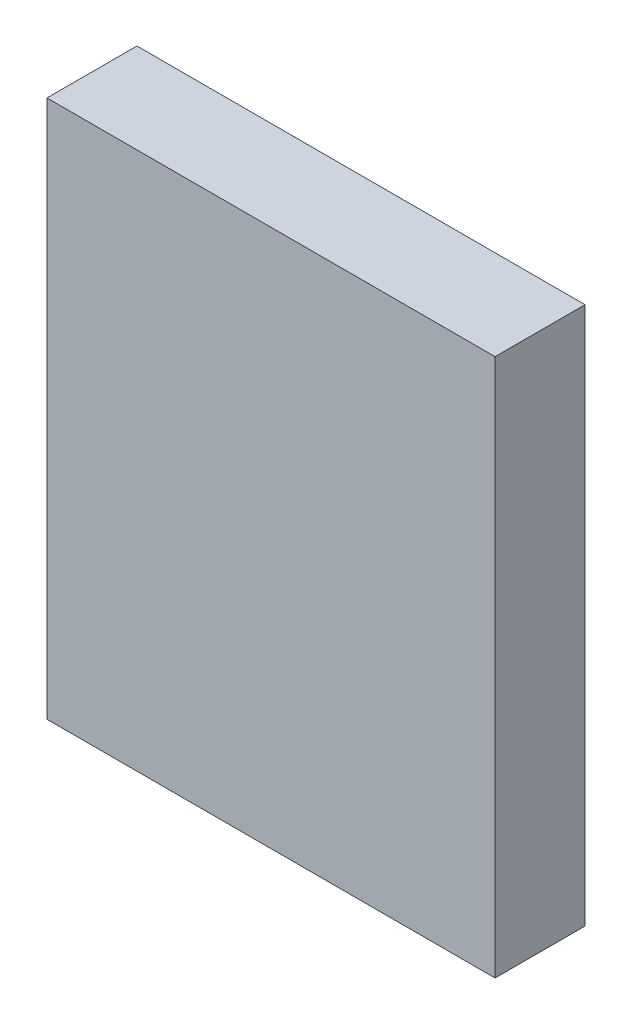
ISO-10303-21;
HEADER;
FILE_DESCRIPTION(('STEP AP214'),'2;1');
FILE_NAME('part.step','',(''),(''),'','','');
FILE_SCHEMA(('AUTOMOTIVE_DESIGN { 1 0 10303 214 1 1 1 1 }'));
ENDSEC;
DATA;
#1=APPLICATION_CONTEXT('core data for automotive mechanical design processes');
#2=APPLICATION_PROTOCOL_DEFINITION('international standard','automotive_design',2000,#1);
#3=PRODUCT_CONTEXT('',#1,'mechanical');
#4=PRODUCT('Part','Part','',(#3));
#5=PRODUCT_RELATED_PRODUCT_CATEGORY('part','',(#4));
#6=PRODUCT_DEFINITION_FORMATION('','',#4);
#7=PRODUCT_DEFINITION_CONTEXT('part definition',#1,'design');
#8=PRODUCT_DEFINITION('design','',#6,#7);
#9=PRODUCT_DEFINITION_SHAPE('','',#8);
#10=(LENGTH_UNIT() NAMED_UNIT(*) SI_UNIT(.MILLI.,.METRE.));
#11=(NAMED_UNIT(*) PLANE_ANGLE_UNIT() SI_UNIT($,.RADIAN.));
#12=(NAMED_UNIT(*) SI_UNIT($,.STERADIAN.) SOLID_ANGLE_UNIT());
#13=UNCERTAINTY_MEASURE_WITH_UNIT(LENGTH_MEASURE(1.E-05),#10,'distance_accuracy_value','');
#14=(GEOMETRIC_REPRESENTATION_CONTEXT(3) GLOBAL_UNCERTAINTY_ASSIGNED_CONTEXT((#13)) GLOBAL_UNIT_ASSIGNED_CONTEXT((#10,
#11,#12)) REPRESENTATION_CONTEXT('',''));
#15=CARTESIAN_POINT('',(0.,0.,0.));
#16=DIRECTION('',(0.,0.,1.));
#17=DIRECTION('',(1.,0.,0.));
#18=AXIS2_PLACEMENT_3D('',#15,#16,#17);
#19=CARTESIAN_POINT('',(0.373,0.698,0.));
#20=DIRECTION('',(0.,-1.,0.));
#21=DIRECTION('',(0.,0.,1.));
#22=AXIS2_PLACEMENT_3D('',#19,#20,#21);
#23=PLANE('',#22);
#24=DIRECTION('',(-1.,0.,0.));
#25=VECTOR('',#24,1.);
#26=CARTESIAN_POINT('',(0.627,0.698,0.));
#27=LINE('',#26,#25);
#28=CARTESIAN_POINT('',(0.627,0.698,0.));
#29=VERTEX_POINT('',#28);
#30=CARTESIAN_POINT('',(0.373,0.698,0.));
#31=VERTEX_POINT('',#30);
#32=EDGE_CURVE('E11',#29,#31,#27,.T.);
#33=ORIENTED_EDGE('',*,*,#32,.F.);
#34=DIRECTION('',(0.,0.,-1.));
#35=VECTOR('',#34,1.);
#36=CARTESIAN_POINT('',(0.627,0.698,0.051));
#37=LINE('',#36,#35);
#38=CARTESIAN_POINT('',(0.627,0.698,0.051));
#39=VERTEX_POINT('',#38);
#40=EDGE_CURVE('E24',#39,#29,#37,.T.);
#41=ORIENTED_EDGE('',*,*,#40,.F.);
#42=DIRECTION('',(1.,0.,0.));
#43=VECTOR('',#42,1.);
#44=CARTESIAN_POINT('',(0.373,0.698,0.051));
#45=LINE('',#44,#43);
#46=CARTESIAN_POINT('',(0.373,0.698,0.051));
#47=VERTEX_POINT('',#46);
#48=EDGE_CURVE('E88',#47,#39,#45,.T.);
#49=ORIENTED_EDGE('',*,*,#48,.F.);
#50=DIRECTION('',(0.,0.,1.));
#51=VECTOR('',#50,1.);
#52=CARTESIAN_POINT('',(0.373,0.698,0.));
#53=LINE('',#52,#51);
#54=EDGE_CURVE('E77',#31,#47,#53,.T.);
#55=ORIENTED_EDGE('',*,*,#54,.F.);
#56=EDGE_LOOP('',(#33,#41,#49,#55));
#57=FACE_BOUND('',#56,.T.);
#58=ADVANCED_FACE('F17',(#57),#23,.T.);
#59=CARTESIAN_POINT('',(0.627,0.698,0.));
#60=DIRECTION('',(1.,0.,0.));
#61=DIRECTION('',(0.,0.,1.));
#62=AXIS2_PLACEMENT_3D('',#59,#60,#61);
#63=PLANE('',#62);
#64=DIRECTION('',(0.,-1.,0.));
#65=VECTOR('',#64,1.);
#66=CARTESIAN_POINT('',(0.627,1.003,0.));
#67=LINE('',#66,#65);
#68=CARTESIAN_POINT('',(0.627,1.003,0.));
#69=VERTEX_POINT('',#68);
#70=EDGE_CURVE('E85',#69,#29,#67,.T.);
#71=ORIENTED_EDGE('',*,*,#70,.F.);
#72=DIRECTION('',(0.,0.,-1.));
#73=VECTOR('',#72,1.);
#74=CARTESIAN_POINT('',(0.627,1.003,0.051));
#75=LINE('',#74,#73);
#76=CARTESIAN_POINT('',(0.627,1.003,0.051));
#77=VERTEX_POINT('',#76);
#78=EDGE_CURVE('E83',#77,#69,#75,.T.);
#79=ORIENTED_EDGE('',*,*,#78,.F.);
#80=DIRECTION('',(0.,1.,0.));
#81=VECTOR('',#80,1.);
#82=CARTESIAN_POINT('',(0.627,0.698,0.051));
#83=LINE('',#82,#81);
#84=EDGE_CURVE('E72',#39,#77,#83,.T.);
#85=ORIENTED_EDGE('',*,*,#84,.F.);
#86=ORIENTED_EDGE('',*,*,#40,.T.);
#87=EDGE_LOOP('',(#71,#79,#85,#86));
#88=FACE_BOUND('',#87,.T.);
#89=ADVANCED_FACE('F90',(#88),#63,.T.);
#90=CARTESIAN_POINT('',(0.627,1.003,0.));
#91=DIRECTION('',(0.,1.,0.));
#92=DIRECTION('',(0.,0.,1.));
#93=AXIS2_PLACEMENT_3D('',#90,#91,#92);
#94=PLANE('',#93);
#95=DIRECTION('',(1.,0.,0.));
#96=VECTOR('',#95,1.);
#97=CARTESIAN_POINT('',(0.373,1.003,0.));
#98=LINE('',#97,#96);
#99=CARTESIAN_POINT('',(0.373,1.003,0.));
#100=VERTEX_POINT('',#99);
#101=EDGE_CURVE('E60',#100,#69,#98,.T.);
#102=ORIENTED_EDGE('',*,*,#101,.F.);
#103=DIRECTION('',(0.,0.,-1.));
#104=VECTOR('',#103,1.);
#105=CARTESIAN_POINT('',(0.373,1.003,0.051));
#106=LINE('',#105,#104);
#107=CARTESIAN_POINT('',(0.373,1.003,0.051));
#108=VERTEX_POINT('',#107);
#109=EDGE_CURVE('E54',#108,#100,#106,.T.);
#110=ORIENTED_EDGE('',*,*,#109,.F.);
#111=DIRECTION('',(-1.,0.,0.));
#112=VECTOR('',#111,1.);
#113=CARTESIAN_POINT('',(0.627,1.003,0.051));
#114=LINE('',#113,#112);
#115=EDGE_CURVE('E58',#77,#108,#114,.T.);
#116=ORIENTED_EDGE('',*,*,#115,.F.);
#117=ORIENTED_EDGE('',*,*,#78,.T.);
#118=EDGE_LOOP('',(#102,#110,#116,#117));
#119=FACE_BOUND('',#118,.T.);
#120=ADVANCED_FACE('F56',(#119),#94,.T.);
#121=CARTESIAN_POINT('',(0.373,1.003,0.));
#122=DIRECTION('',(-1.,0.,0.));
#123=DIRECTION('',(0.,0.,1.));
#124=AXIS2_PLACEMENT_3D('',#121,#122,#123);
#125=PLANE('',#124);
#126=DIRECTION('',(0.,1.,0.));
#127=VECTOR('',#126,1.);
#128=CARTESIAN_POINT('',(0.373,0.698,0.));
#129=LINE('',#128,#127);
#130=EDGE_CURVE('E73',#31,#100,#129,.T.);
#131=ORIENTED_EDGE('',*,*,#130,.F.);
#132=ORIENTED_EDGE('',*,*,#54,.T.);
#133=DIRECTION('',(0.,-1.,0.));
#134=VECTOR('',#133,1.);
#135=CARTESIAN_POINT('',(0.373,1.003,0.051));
#136=LINE('',#135,#134);
#137=EDGE_CURVE('E70',#108,#47,#136,.T.);
#138=ORIENTED_EDGE('',*,*,#137,.F.);
#139=ORIENTED_EDGE('',*,*,#109,.T.);
#140=EDGE_LOOP('',(#131,#132,#138,#139));
#141=FACE_BOUND('',#140,.T.);
#142=ADVANCED_FACE('F76',(#141),#125,.T.);
#143=CARTESIAN_POINT('',(0.373,1.003,0.));
#144=DIRECTION('',(0.,0.,-1.));
#145=DIRECTION('',(0.,1.,0.));
#146=AXIS2_PLACEMENT_3D('',#143,#144,#145);
#147=PLANE('',#146);
#148=ORIENTED_EDGE('',*,*,#101,.T.);
#149=ORIENTED_EDGE('',*,*,#70,.T.);
#150=ORIENTED_EDGE('',*,*,#32,.T.);
#151=ORIENTED_EDGE('',*,*,#130,.T.);
#152=EDGE_LOOP('',(#148,#149,#150,#151));
#153=FACE_BOUND('',#152,.T.);
#154=ADVANCED_FACE('F91',(#153),#147,.T.);
#155=CARTESIAN_POINT('',(0.373,0.698,0.051));
#156=DIRECTION('',(0.,0.,1.));
#157=DIRECTION('',(0.,1.,0.));
#158=AXIS2_PLACEMENT_3D('',#155,#156,#157);
#159=PLANE('',#158);
#160=ORIENTED_EDGE('',*,*,#48,.T.);
#161=ORIENTED_EDGE('',*,*,#84,.T.);
#162=ORIENTED_EDGE('',*,*,#115,.T.);
#163=ORIENTED_EDGE('',*,*,#137,.T.);
#164=EDGE_LOOP('',(#160,#161,#162,#163));
#165=FACE_BOUND('',#164,.T.);
#166=ADVANCED_FACE('F69',(#165),#159,.T.);
#167=CLOSED_SHELL('',(#58,#89,#120,#142,#154,#166));
#168=MANIFOLD_SOLID_BREP('B1',#167);
#169=ADVANCED_BREP_SHAPE_REPRESENTATION('',(#18,#168),#14);
#170=SHAPE_DEFINITION_REPRESENTATION(#9,#169);
ENDSEC;
END-ISO-10303-21;
